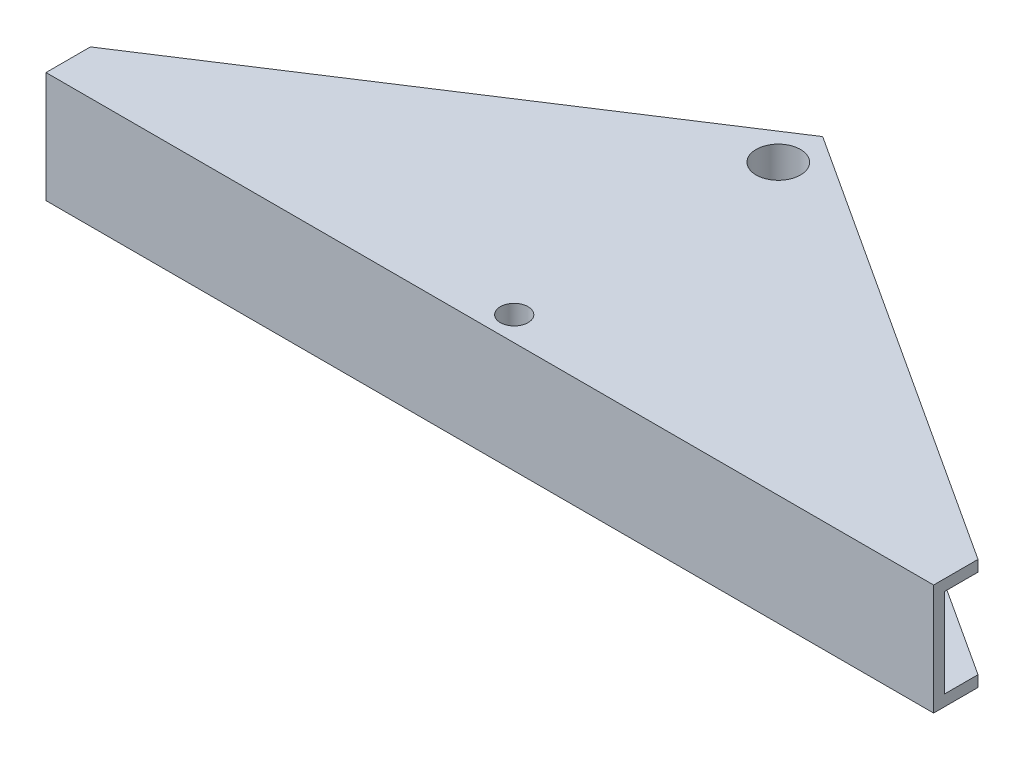
ISO-10303-21;
HEADER;
FILE_DESCRIPTION(('STEP AP214'),'2;1');
FILE_NAME('part.step','',(''),(''),'','','');
FILE_SCHEMA(('AUTOMOTIVE_DESIGN { 1 0 10303 214 1 1 1 1 }'));
ENDSEC;
DATA;
#1=APPLICATION_CONTEXT('core data for automotive mechanical design processes');
#2=APPLICATION_PROTOCOL_DEFINITION('international standard','automotive_design',2000,#1);
#3=PRODUCT_CONTEXT('',#1,'mechanical');
#4=PRODUCT('Part','Part','',(#3));
#5=PRODUCT_RELATED_PRODUCT_CATEGORY('part','',(#4));
#6=PRODUCT_DEFINITION_FORMATION('','',#4);
#7=PRODUCT_DEFINITION_CONTEXT('part definition',#1,'design');
#8=PRODUCT_DEFINITION('design','',#6,#7);
#9=PRODUCT_DEFINITION_SHAPE('','',#8);
#10=(LENGTH_UNIT() NAMED_UNIT(*) SI_UNIT(.MILLI.,.METRE.));
#11=(NAMED_UNIT(*) PLANE_ANGLE_UNIT() SI_UNIT($,.RADIAN.));
#12=(NAMED_UNIT(*) SI_UNIT($,.STERADIAN.) SOLID_ANGLE_UNIT());
#13=UNCERTAINTY_MEASURE_WITH_UNIT(LENGTH_MEASURE(1.E-05),#10,'distance_accuracy_value','');
#14=(GEOMETRIC_REPRESENTATION_CONTEXT(3) GLOBAL_UNCERTAINTY_ASSIGNED_CONTEXT((#13)) GLOBAL_UNIT_ASSIGNED_CONTEXT((#10,
#11,#12)) REPRESENTATION_CONTEXT('',''));
#15=CARTESIAN_POINT('',(0.,0.,0.));
#16=DIRECTION('',(0.,0.,1.));
#17=DIRECTION('',(1.,0.,0.));
#18=AXIS2_PLACEMENT_3D('',#15,#16,#17);
#19=CARTESIAN_POINT('',(40.,10.,0.));
#20=DIRECTION('',(-0.544988350595414,0.,0.838443616300637));
#21=DIRECTION('',(0.838443616300637,0.,0.544988350595414));
#22=AXIS2_PLACEMENT_3D('',#19,#20,#21);
#23=PLANE('',#22);
#24=DIRECTION('',(-0.838443616300637,0.,-0.544988350595414));
#25=VECTOR('',#24,1.);
#26=CARTESIAN_POINT('',(40.,1.,0.));
#27=LINE('',#26,#25);
#28=CARTESIAN_POINT('',(40.,1.,0.));
#29=VERTEX_POINT('',#28);
#30=CARTESIAN_POINT('',(3.44258281659152,1.,-23.7623211692155));
#31=VERTEX_POINT('',#30);
#32=EDGE_CURVE('E153',#29,#31,#27,.T.);
#33=ORIENTED_EDGE('',*,*,#32,.F.);
#34=DIRECTION('',(0.,-1.,0.));
#35=VECTOR('',#34,1.);
#36=CARTESIAN_POINT('',(40.,10.,0.));
#37=LINE('',#36,#35);
#38=CARTESIAN_POINT('',(40.,0.,0.));
#39=VERTEX_POINT('',#38);
#40=EDGE_CURVE('E206',#29,#39,#37,.T.);
#41=ORIENTED_EDGE('',*,*,#40,.T.);
#42=DIRECTION('',(-0.838443616300637,0.,-0.544988350595414));
#43=VECTOR('',#42,1.);
#44=CARTESIAN_POINT('',(40.,0.,0.));
#45=LINE('',#44,#43);
#46=CARTESIAN_POINT('',(0.,0.,-26.));
#47=VERTEX_POINT('',#46);
#48=EDGE_CURVE('E191',#39,#47,#45,.T.);
#49=ORIENTED_EDGE('',*,*,#48,.T.);
#50=DIRECTION('',(0.,-1.,0.));
#51=VECTOR('',#50,1.);
#52=CARTESIAN_POINT('',(0.,10.,-26.));
#53=LINE('',#52,#51);
#54=CARTESIAN_POINT('',(0.,10.,-26.));
#55=VERTEX_POINT('',#54);
#56=EDGE_CURVE('E231',#55,#47,#53,.T.);
#57=ORIENTED_EDGE('',*,*,#56,.F.);
#58=DIRECTION('',(-0.838443616300637,0.,-0.544988350595414));
#59=VECTOR('',#58,1.);
#60=CARTESIAN_POINT('',(40.,10.,0.));
#61=LINE('',#60,#59);
#62=CARTESIAN_POINT('',(40.,10.,0.));
#63=VERTEX_POINT('',#62);
#64=EDGE_CURVE('E194',#63,#55,#61,.T.);
#65=ORIENTED_EDGE('',*,*,#64,.F.);
#66=CARTESIAN_POINT('',(40.,9.,0.));
#67=VERTEX_POINT('',#66);
#68=EDGE_CURVE('E218',#63,#67,#37,.T.);
#69=ORIENTED_EDGE('',*,*,#68,.T.);
#70=DIRECTION('',(-0.838443616300637,0.,-0.544988350595414));
#71=VECTOR('',#70,1.);
#72=CARTESIAN_POINT('',(40.,9.,0.));
#73=LINE('',#72,#71);
#74=CARTESIAN_POINT('',(3.44258281659152,9.,-23.7623211692155));
#75=VERTEX_POINT('',#74);
#76=EDGE_CURVE('E51',#67,#75,#73,.T.);
#77=ORIENTED_EDGE('',*,*,#76,.T.);
#78=DIRECTION('',(0.,1.,0.));
#79=VECTOR('',#78,1.);
#80=CARTESIAN_POINT('',(3.44258281659152,10.,-23.7623211692155));
#81=LINE('',#80,#79);
#82=EDGE_CURVE('E11',#31,#75,#81,.T.);
#83=ORIENTED_EDGE('',*,*,#82,.F.);
#84=EDGE_LOOP('',(#33,#41,#49,#57,#65,#69,#77,#83));
#85=FACE_BOUND('',#84,.T.);
#86=ADVANCED_FACE('F37',(#85),#23,.F.);
#87=CARTESIAN_POINT('',(40.,10.,4.));
#88=DIRECTION('',(-1.,0.,0.));
#89=DIRECTION('',(0.,0.,1.));
#90=AXIS2_PLACEMENT_3D('',#87,#88,#89);
#91=PLANE('',#90);
#92=DIRECTION('',(0.,0.,-1.));
#93=VECTOR('',#92,1.);
#94=CARTESIAN_POINT('',(40.,1.,4.));
#95=LINE('',#94,#93);
#96=CARTESIAN_POINT('',(40.,1.,3.));
#97=VERTEX_POINT('',#96);
#98=EDGE_CURVE('E44',#97,#29,#95,.T.);
#99=ORIENTED_EDGE('',*,*,#98,.F.);
#100=DIRECTION('',(0.,1.,0.));
#101=VECTOR('',#100,1.);
#102=CARTESIAN_POINT('',(40.,1.,3.));
#103=LINE('',#102,#101);
#104=CARTESIAN_POINT('',(40.,9.,3.));
#105=VERTEX_POINT('',#104);
#106=EDGE_CURVE('E139',#97,#105,#103,.T.);
#107=ORIENTED_EDGE('',*,*,#106,.T.);
#108=DIRECTION('',(0.,0.,-1.));
#109=VECTOR('',#108,1.);
#110=CARTESIAN_POINT('',(40.,9.,4.));
#111=LINE('',#110,#109);
#112=EDGE_CURVE('E242',#105,#67,#111,.T.);
#113=ORIENTED_EDGE('',*,*,#112,.T.);
#114=ORIENTED_EDGE('',*,*,#68,.F.);
#115=DIRECTION('',(0.,0.,-1.));
#116=VECTOR('',#115,1.);
#117=CARTESIAN_POINT('',(40.,10.,4.));
#118=LINE('',#117,#116);
#119=CARTESIAN_POINT('',(40.,10.,4.));
#120=VERTEX_POINT('',#119);
#121=EDGE_CURVE('E204',#120,#63,#118,.T.);
#122=ORIENTED_EDGE('',*,*,#121,.F.);
#123=DIRECTION('',(0.,-1.,0.));
#124=VECTOR('',#123,1.);
#125=CARTESIAN_POINT('',(40.,10.,4.));
#126=LINE('',#125,#124);
#127=CARTESIAN_POINT('',(40.,0.,4.));
#128=VERTEX_POINT('',#127);
#129=EDGE_CURVE('E221',#120,#128,#126,.T.);
#130=ORIENTED_EDGE('',*,*,#129,.T.);
#131=DIRECTION('',(0.,0.,-1.));
#132=VECTOR('',#131,1.);
#133=CARTESIAN_POINT('',(40.,0.,4.));
#134=LINE('',#133,#132);
#135=EDGE_CURVE('E198',#128,#39,#134,.T.);
#136=ORIENTED_EDGE('',*,*,#135,.T.);
#137=ORIENTED_EDGE('',*,*,#40,.F.);
#138=EDGE_LOOP('',(#99,#107,#113,#114,#122,#130,#136,#137));
#139=FACE_BOUND('',#138,.T.);
#140=ADVANCED_FACE('F246',(#139),#91,.F.);
#141=CARTESIAN_POINT('',(0.,10.,-26.));
#142=DIRECTION('',(0.544988350595414,0.,0.838443616300637));
#143=DIRECTION('',(0.838443616300637,0.,-0.544988350595414));
#144=AXIS2_PLACEMENT_3D('',#141,#142,#143);
#145=PLANE('',#144);
#146=DIRECTION('',(-0.838443616300637,0.,0.544988350595414));
#147=VECTOR('',#146,1.);
#148=CARTESIAN_POINT('',(0.,1.,-26.));
#149=LINE('',#148,#147);
#150=CARTESIAN_POINT('',(-3.44258281659152,1.,-23.7623211692155));
#151=VERTEX_POINT('',#150);
#152=CARTESIAN_POINT('',(-40.,1.,0.));
#153=VERTEX_POINT('',#152);
#154=EDGE_CURVE('E179',#151,#153,#149,.T.);
#155=ORIENTED_EDGE('',*,*,#154,.F.);
#156=DIRECTION('',(0.,1.,0.));
#157=VECTOR('',#156,1.);
#158=CARTESIAN_POINT('',(-3.44258281659152,10.,-23.7623211692155));
#159=LINE('',#158,#157);
#160=CARTESIAN_POINT('',(-3.44258281659152,9.,-23.7623211692155));
#161=VERTEX_POINT('',#160);
#162=EDGE_CURVE('E239',#151,#161,#159,.T.);
#163=ORIENTED_EDGE('',*,*,#162,.T.);
#164=DIRECTION('',(-0.838443616300637,0.,0.544988350595414));
#165=VECTOR('',#164,1.);
#166=CARTESIAN_POINT('',(0.,9.,-26.));
#167=LINE('',#166,#165);
#168=CARTESIAN_POINT('',(-40.,9.,0.));
#169=VERTEX_POINT('',#168);
#170=EDGE_CURVE('E175',#161,#169,#167,.T.);
#171=ORIENTED_EDGE('',*,*,#170,.T.);
#172=DIRECTION('',(0.,-1.,0.));
#173=VECTOR('',#172,1.);
#174=CARTESIAN_POINT('',(-40.,10.,0.));
#175=LINE('',#174,#173);
#176=CARTESIAN_POINT('',(-40.,10.,0.));
#177=VERTEX_POINT('',#176);
#178=EDGE_CURVE('E228',#177,#169,#175,.T.);
#179=ORIENTED_EDGE('',*,*,#178,.F.);
#180=DIRECTION('',(-0.838443616300637,0.,0.544988350595414));
#181=VECTOR('',#180,1.);
#182=CARTESIAN_POINT('',(0.,10.,-26.));
#183=LINE('',#182,#181);
#184=EDGE_CURVE('E197',#55,#177,#183,.T.);
#185=ORIENTED_EDGE('',*,*,#184,.F.);
#186=ORIENTED_EDGE('',*,*,#56,.T.);
#187=DIRECTION('',(-0.838443616300637,0.,0.544988350595414));
#188=VECTOR('',#187,1.);
#189=CARTESIAN_POINT('',(0.,0.,-26.));
#190=LINE('',#189,#188);
#191=CARTESIAN_POINT('',(-40.,0.,0.));
#192=VERTEX_POINT('',#191);
#193=EDGE_CURVE('E209',#47,#192,#190,.T.);
#194=ORIENTED_EDGE('',*,*,#193,.T.);
#195=EDGE_CURVE('E227',#153,#192,#175,.T.);
#196=ORIENTED_EDGE('',*,*,#195,.F.);
#197=EDGE_LOOP('',(#155,#163,#171,#179,#185,#186,#194,#196));
#198=FACE_BOUND('',#197,.T.);
#199=ADVANCED_FACE('F260',(#198),#145,.F.);
#200=CARTESIAN_POINT('',(-40.,10.,0.));
#201=DIRECTION('',(1.,0.,0.));
#202=DIRECTION('',(0.,0.,-1.));
#203=AXIS2_PLACEMENT_3D('',#200,#201,#202);
#204=PLANE('',#203);
#205=DIRECTION('',(0.,0.,1.));
#206=VECTOR('',#205,1.);
#207=CARTESIAN_POINT('',(-40.,1.,0.));
#208=LINE('',#207,#206);
#209=CARTESIAN_POINT('',(-40.,1.,3.));
#210=VERTEX_POINT('',#209);
#211=EDGE_CURVE('E237',#153,#210,#208,.T.);
#212=ORIENTED_EDGE('',*,*,#211,.F.);
#213=ORIENTED_EDGE('',*,*,#195,.T.);
#214=DIRECTION('',(0.,0.,1.));
#215=VECTOR('',#214,1.);
#216=CARTESIAN_POINT('',(-40.,0.,0.));
#217=LINE('',#216,#215);
#218=CARTESIAN_POINT('',(-40.,0.,4.));
#219=VERTEX_POINT('',#218);
#220=EDGE_CURVE('E212',#192,#219,#217,.T.);
#221=ORIENTED_EDGE('',*,*,#220,.T.);
#222=DIRECTION('',(0.,-1.,0.));
#223=VECTOR('',#222,1.);
#224=CARTESIAN_POINT('',(-40.,10.,4.));
#225=LINE('',#224,#223);
#226=CARTESIAN_POINT('',(-40.,10.,4.));
#227=VERTEX_POINT('',#226);
#228=EDGE_CURVE('E224',#227,#219,#225,.T.);
#229=ORIENTED_EDGE('',*,*,#228,.F.);
#230=DIRECTION('',(0.,0.,1.));
#231=VECTOR('',#230,1.);
#232=CARTESIAN_POINT('',(-40.,10.,0.));
#233=LINE('',#232,#231);
#234=EDGE_CURVE('E200',#177,#227,#233,.T.);
#235=ORIENTED_EDGE('',*,*,#234,.F.);
#236=ORIENTED_EDGE('',*,*,#178,.T.);
#237=DIRECTION('',(0.,0.,1.));
#238=VECTOR('',#237,1.);
#239=CARTESIAN_POINT('',(-40.,9.,0.));
#240=LINE('',#239,#238);
#241=CARTESIAN_POINT('',(-40.,9.,3.));
#242=VERTEX_POINT('',#241);
#243=EDGE_CURVE('E234',#169,#242,#240,.T.);
#244=ORIENTED_EDGE('',*,*,#243,.T.);
#245=DIRECTION('',(0.,1.,0.));
#246=VECTOR('',#245,1.);
#247=CARTESIAN_POINT('',(-40.,1.,3.));
#248=LINE('',#247,#246);
#249=EDGE_CURVE('E169',#210,#242,#248,.T.);
#250=ORIENTED_EDGE('',*,*,#249,.F.);
#251=EDGE_LOOP('',(#212,#213,#221,#229,#235,#236,#244,#250));
#252=FACE_BOUND('',#251,.T.);
#253=ADVANCED_FACE('F286',(#252),#204,.F.);
#254=CARTESIAN_POINT('',(0.,10.,0.));
#255=DIRECTION('',(0.,1.,0.));
#256=DIRECTION('',(0.,0.,1.));
#257=AXIS2_PLACEMENT_3D('',#254,#255,#256);
#258=PLANE('',#257);
#259=CARTESIAN_POINT('',(0.,10.,-22.));
#260=DIRECTION('',(0.,1.,0.));
#261=DIRECTION('',(0.,0.,1.));
#262=AXIS2_PLACEMENT_3D('',#259,#260,#261);
#263=CIRCLE('',#262,2.);
#264=CARTESIAN_POINT('',(0.,10.,-20.));
#265=VERTEX_POINT('',#264);
#266=EDGE_CURVE('E188',#265,#265,#263,.T.);
#267=ORIENTED_EDGE('',*,*,#266,.F.);
#268=EDGE_LOOP('',(#267));
#269=FACE_BOUND('',#268,.T.);
#270=ORIENTED_EDGE('',*,*,#64,.T.);
#271=ORIENTED_EDGE('',*,*,#184,.T.);
#272=ORIENTED_EDGE('',*,*,#234,.T.);
#273=DIRECTION('',(1.,0.,0.));
#274=VECTOR('',#273,1.);
#275=CARTESIAN_POINT('',(-40.,10.,4.));
#276=LINE('',#275,#274);
#277=EDGE_CURVE('E202',#227,#120,#276,.T.);
#278=ORIENTED_EDGE('',*,*,#277,.T.);
#279=ORIENTED_EDGE('',*,*,#121,.T.);
#280=EDGE_LOOP('',(#270,#271,#272,#278,#279));
#281=FACE_BOUND('',#280,.T.);
#282=CARTESIAN_POINT('',(0.,10.,1.8));
#283=DIRECTION('',(0.,1.,0.));
#284=DIRECTION('',(0.,0.,1.));
#285=AXIS2_PLACEMENT_3D('',#282,#283,#284);
#286=CIRCLE('',#285,1.25);
#287=CARTESIAN_POINT('',(0.,10.,3.05));
#288=VERTEX_POINT('',#287);
#289=EDGE_CURVE('E182',#288,#288,#286,.T.);
#290=ORIENTED_EDGE('',*,*,#289,.F.);
#291=EDGE_LOOP('',(#290));
#292=FACE_BOUND('',#291,.T.);
#293=ADVANCED_FACE('F265',(#269,#281,#292),#258,.T.);
#294=CARTESIAN_POINT('',(0.,0.,0.));
#295=DIRECTION('',(0.,1.,0.));
#296=DIRECTION('',(0.,0.,1.));
#297=AXIS2_PLACEMENT_3D('',#294,#295,#296);
#298=PLANE('',#297);
#299=ORIENTED_EDGE('',*,*,#48,.F.);
#300=ORIENTED_EDGE('',*,*,#135,.F.);
#301=DIRECTION('',(1.,0.,0.));
#302=VECTOR('',#301,1.);
#303=CARTESIAN_POINT('',(-40.,0.,4.));
#304=LINE('',#303,#302);
#305=EDGE_CURVE('E214',#219,#128,#304,.T.);
#306=ORIENTED_EDGE('',*,*,#305,.F.);
#307=ORIENTED_EDGE('',*,*,#220,.F.);
#308=ORIENTED_EDGE('',*,*,#193,.F.);
#309=EDGE_LOOP('',(#299,#300,#306,#307,#308));
#310=FACE_BOUND('',#309,.T.);
#311=CARTESIAN_POINT('',(0.,0.,-22.));
#312=DIRECTION('',(0.,1.,0.));
#313=DIRECTION('',(0.,0.,1.));
#314=AXIS2_PLACEMENT_3D('',#311,#312,#313);
#315=CIRCLE('',#314,2.);
#316=CARTESIAN_POINT('',(0.,0.,-20.));
#317=VERTEX_POINT('',#316);
#318=EDGE_CURVE('E185',#317,#317,#315,.T.);
#319=ORIENTED_EDGE('',*,*,#318,.T.);
#320=EDGE_LOOP('',(#319));
#321=FACE_BOUND('',#320,.T.);
#322=CARTESIAN_POINT('',(0.,0.,1.8));
#323=DIRECTION('',(0.,1.,0.));
#324=DIRECTION('',(0.,0.,1.));
#325=AXIS2_PLACEMENT_3D('',#322,#323,#324);
#326=CIRCLE('',#325,1.25);
#327=CARTESIAN_POINT('',(0.,0.,3.05));
#328=VERTEX_POINT('',#327);
#329=EDGE_CURVE('E181',#328,#328,#326,.T.);
#330=ORIENTED_EDGE('',*,*,#329,.T.);
#331=EDGE_LOOP('',(#330));
#332=FACE_BOUND('',#331,.T.);
#333=ADVANCED_FACE('F253',(#310,#321,#332),#298,.F.);
#334=CARTESIAN_POINT('',(-40.,10.,4.));
#335=DIRECTION('',(0.,0.,-1.));
#336=DIRECTION('',(-1.,0.,0.));
#337=AXIS2_PLACEMENT_3D('',#334,#335,#336);
#338=PLANE('',#337);
#339=ORIENTED_EDGE('',*,*,#305,.T.);
#340=ORIENTED_EDGE('',*,*,#129,.F.);
#341=ORIENTED_EDGE('',*,*,#277,.F.);
#342=ORIENTED_EDGE('',*,*,#228,.T.);
#343=EDGE_LOOP('',(#339,#340,#341,#342));
#344=FACE_BOUND('',#343,.T.);
#345=ADVANCED_FACE('F290',(#344),#338,.F.);
#346=CARTESIAN_POINT('',(0.,10.,-22.));
#347=DIRECTION('',(0.,-1.,0.));
#348=DIRECTION('',(0.,0.,-1.));
#349=AXIS2_PLACEMENT_3D('',#346,#347,#348);
#350=CYLINDRICAL_SURFACE('',#349,2.);
#351=ORIENTED_EDGE('',*,*,#266,.T.);
#352=EDGE_LOOP('',(#351));
#353=FACE_BOUND('',#352,.T.);
#354=ORIENTED_EDGE('',*,*,#318,.F.);
#355=EDGE_LOOP('',(#354));
#356=FACE_BOUND('',#355,.T.);
#357=ADVANCED_FACE('F293',(#353,#356),#350,.F.);
#358=CARTESIAN_POINT('',(0.,10.,1.8));
#359=DIRECTION('',(0.,-1.,0.));
#360=DIRECTION('',(0.,0.,-1.));
#361=AXIS2_PLACEMENT_3D('',#358,#359,#360);
#362=CYLINDRICAL_SURFACE('',#361,1.25);
#363=ORIENTED_EDGE('',*,*,#289,.T.);
#364=EDGE_LOOP('',(#363));
#365=FACE_BOUND('',#364,.T.);
#366=ORIENTED_EDGE('',*,*,#329,.F.);
#367=EDGE_LOOP('',(#366));
#368=FACE_BOUND('',#367,.T.);
#369=ADVANCED_FACE('F324',(#365,#368),#362,.F.);
#370=CARTESIAN_POINT('',(-3.,1.,-26.));
#371=DIRECTION('',(0.9809960236947,0.,0.194027836907976));
#372=DIRECTION('',(0.194027836907976,0.,-0.9809960236947));
#373=AXIS2_PLACEMENT_3D('',#370,#371,#372);
#374=PLANE('',#373);
#375=DIRECTION('',(0.194027836907976,0.,-0.9809960236947));
#376=VECTOR('',#375,1.);
#377=CARTESIAN_POINT('',(-3.,1.,-26.));
#378=LINE('',#377,#376);
#379=CARTESIAN_POINT('',(-7.74687763590838,1.,-2.));
#380=VERTEX_POINT('',#379);
#381=EDGE_CURVE('E165',#380,#151,#378,.T.);
#382=ORIENTED_EDGE('',*,*,#381,.F.);
#383=DIRECTION('',(0.,1.,0.));
#384=VECTOR('',#383,1.);
#385=CARTESIAN_POINT('',(-7.74687763590838,1.,-2.));
#386=LINE('',#385,#384);
#387=CARTESIAN_POINT('',(-7.74687763590838,9.,-2.));
#388=VERTEX_POINT('',#387);
#389=EDGE_CURVE('E173',#380,#388,#386,.T.);
#390=ORIENTED_EDGE('',*,*,#389,.T.);
#391=DIRECTION('',(0.194027836907976,0.,-0.9809960236947));
#392=VECTOR('',#391,1.);
#393=CARTESIAN_POINT('',(-3.,9.,-26.));
#394=LINE('',#393,#392);
#395=EDGE_CURVE('E166',#388,#161,#394,.T.);
#396=ORIENTED_EDGE('',*,*,#395,.T.);
#397=ORIENTED_EDGE('',*,*,#162,.F.);
#398=EDGE_LOOP('',(#382,#390,#396,#397));
#399=FACE_BOUND('',#398,.T.);
#400=ADVANCED_FACE('F308',(#399),#374,.F.);
#401=CARTESIAN_POINT('',(0.,1.,0.));
#402=DIRECTION('',(0.,1.,0.));
#403=DIRECTION('',(0.,0.,1.));
#404=AXIS2_PLACEMENT_3D('',#401,#402,#403);
#405=PLANE('',#404);
#406=ORIENTED_EDGE('',*,*,#154,.T.);
#407=ORIENTED_EDGE('',*,*,#211,.T.);
#408=DIRECTION('',(0.988196153074663,0.,-0.153193874056493));
#409=VECTOR('',#408,1.);
#410=CARTESIAN_POINT('',(-7.74687763590838,1.,-2.));
#411=LINE('',#410,#409);
#412=EDGE_CURVE('E162',#210,#380,#411,.T.);
#413=ORIENTED_EDGE('',*,*,#412,.T.);
#414=ORIENTED_EDGE('',*,*,#381,.T.);
#415=EDGE_LOOP('',(#406,#407,#413,#414));
#416=FACE_BOUND('',#415,.T.);
#417=ADVANCED_FACE('F305',(#416),#405,.T.);
#418=CARTESIAN_POINT('',(0.,9.,0.));
#419=DIRECTION('',(0.,1.,0.));
#420=DIRECTION('',(0.,0.,1.));
#421=AXIS2_PLACEMENT_3D('',#418,#419,#420);
#422=PLANE('',#421);
#423=ORIENTED_EDGE('',*,*,#395,.F.);
#424=DIRECTION('',(0.988196153074663,0.,-0.153193874056493));
#425=VECTOR('',#424,1.);
#426=CARTESIAN_POINT('',(-7.74687763590838,9.,-2.));
#427=LINE('',#426,#425);
#428=EDGE_CURVE('E59',#242,#388,#427,.T.);
#429=ORIENTED_EDGE('',*,*,#428,.F.);
#430=ORIENTED_EDGE('',*,*,#243,.F.);
#431=ORIENTED_EDGE('',*,*,#170,.F.);
#432=EDGE_LOOP('',(#423,#429,#430,#431));
#433=FACE_BOUND('',#432,.T.);
#434=ADVANCED_FACE('F309',(#433),#422,.F.);
#435=CARTESIAN_POINT('',(-7.74687763590838,1.,-2.));
#436=DIRECTION('',(0.153193874056493,0.,0.988196153074663));
#437=DIRECTION('',(0.988196153074663,0.,-0.153193874056493));
#438=AXIS2_PLACEMENT_3D('',#435,#436,#437);
#439=PLANE('',#438);
#440=ORIENTED_EDGE('',*,*,#428,.T.);
#441=ORIENTED_EDGE('',*,*,#389,.F.);
#442=ORIENTED_EDGE('',*,*,#412,.F.);
#443=ORIENTED_EDGE('',*,*,#249,.T.);
#444=EDGE_LOOP('',(#440,#441,#442,#443));
#445=FACE_BOUND('',#444,.T.);
#446=ADVANCED_FACE('F312',(#445),#439,.F.);
#447=CARTESIAN_POINT('',(3.,1.,-26.));
#448=DIRECTION('',(0.9809960236947,0.,-0.194027836907976));
#449=DIRECTION('',(-0.194027836907976,0.,-0.9809960236947));
#450=AXIS2_PLACEMENT_3D('',#447,#448,#449);
#451=PLANE('',#450);
#452=ORIENTED_EDGE('',*,*,#82,.T.);
#453=DIRECTION('',(-0.194027836907976,0.,-0.9809960236947));
#454=VECTOR('',#453,1.);
#455=CARTESIAN_POINT('',(3.,9.,-26.));
#456=LINE('',#455,#454);
#457=CARTESIAN_POINT('',(7.74687763590838,9.,-2.));
#458=VERTEX_POINT('',#457);
#459=EDGE_CURVE('E149',#458,#75,#456,.T.);
#460=ORIENTED_EDGE('',*,*,#459,.F.);
#461=DIRECTION('',(0.,1.,0.));
#462=VECTOR('',#461,1.);
#463=CARTESIAN_POINT('',(7.74687763590838,1.,-2.));
#464=LINE('',#463,#462);
#465=CARTESIAN_POINT('',(7.74687763590838,1.,-2.));
#466=VERTEX_POINT('',#465);
#467=EDGE_CURVE('E136',#466,#458,#464,.T.);
#468=ORIENTED_EDGE('',*,*,#467,.F.);
#469=DIRECTION('',(-0.194027836907976,0.,-0.9809960236947));
#470=VECTOR('',#469,1.);
#471=CARTESIAN_POINT('',(3.,1.,-26.));
#472=LINE('',#471,#470);
#473=EDGE_CURVE('E143',#466,#31,#472,.T.);
#474=ORIENTED_EDGE('',*,*,#473,.T.);
#475=EDGE_LOOP('',(#452,#460,#468,#474));
#476=FACE_BOUND('',#475,.T.);
#477=ADVANCED_FACE('F147',(#476),#451,.T.);
#478=CARTESIAN_POINT('',(0.,1.,0.));
#479=DIRECTION('',(0.,1.,0.));
#480=DIRECTION('',(0.,0.,1.));
#481=AXIS2_PLACEMENT_3D('',#478,#479,#480);
#482=PLANE('',#481);
#483=ORIENTED_EDGE('',*,*,#32,.T.);
#484=ORIENTED_EDGE('',*,*,#473,.F.);
#485=DIRECTION('',(-0.988196153074663,0.,-0.153193874056493));
#486=VECTOR('',#485,1.);
#487=CARTESIAN_POINT('',(7.74687763590838,1.,-2.));
#488=LINE('',#487,#486);
#489=EDGE_CURVE('E132',#97,#466,#488,.T.);
#490=ORIENTED_EDGE('',*,*,#489,.F.);
#491=ORIENTED_EDGE('',*,*,#98,.T.);
#492=EDGE_LOOP('',(#483,#484,#490,#491));
#493=FACE_BOUND('',#492,.T.);
#494=ADVANCED_FACE('F151',(#493),#482,.T.);
#495=CARTESIAN_POINT('',(0.,9.,0.));
#496=DIRECTION('',(0.,1.,0.));
#497=DIRECTION('',(0.,0.,1.));
#498=AXIS2_PLACEMENT_3D('',#495,#496,#497);
#499=PLANE('',#498);
#500=ORIENTED_EDGE('',*,*,#112,.F.);
#501=DIRECTION('',(-0.988196153074663,0.,-0.153193874056493));
#502=VECTOR('',#501,1.);
#503=CARTESIAN_POINT('',(7.74687763590838,9.,-2.));
#504=LINE('',#503,#502);
#505=EDGE_CURVE('E154',#105,#458,#504,.T.);
#506=ORIENTED_EDGE('',*,*,#505,.T.);
#507=ORIENTED_EDGE('',*,*,#459,.T.);
#508=ORIENTED_EDGE('',*,*,#76,.F.);
#509=EDGE_LOOP('',(#500,#506,#507,#508));
#510=FACE_BOUND('',#509,.T.);
#511=ADVANCED_FACE('F269',(#510),#499,.F.);
#512=CARTESIAN_POINT('',(7.74687763590838,1.,-2.));
#513=DIRECTION('',(0.153193874056493,0.,-0.988196153074663));
#514=DIRECTION('',(-0.988196153074663,0.,-0.153193874056493));
#515=AXIS2_PLACEMENT_3D('',#512,#513,#514);
#516=PLANE('',#515);
#517=ORIENTED_EDGE('',*,*,#505,.F.);
#518=ORIENTED_EDGE('',*,*,#106,.F.);
#519=ORIENTED_EDGE('',*,*,#489,.T.);
#520=ORIENTED_EDGE('',*,*,#467,.T.);
#521=EDGE_LOOP('',(#517,#518,#519,#520));
#522=FACE_BOUND('',#521,.T.);
#523=ADVANCED_FACE('F135',(#522),#516,.T.);
#524=CLOSED_SHELL('',(#86,#140,#199,#253,#293,#333,#345,#357,#369,#400,#417,#434,#446,#477,#494,
#511,#523));
#525=MANIFOLD_SOLID_BREP('B2',#524);
#526=ADVANCED_BREP_SHAPE_REPRESENTATION('',(#18,#525),#14);
#527=SHAPE_DEFINITION_REPRESENTATION(#9,#526);
ENDSEC;
END-ISO-10303-21;
